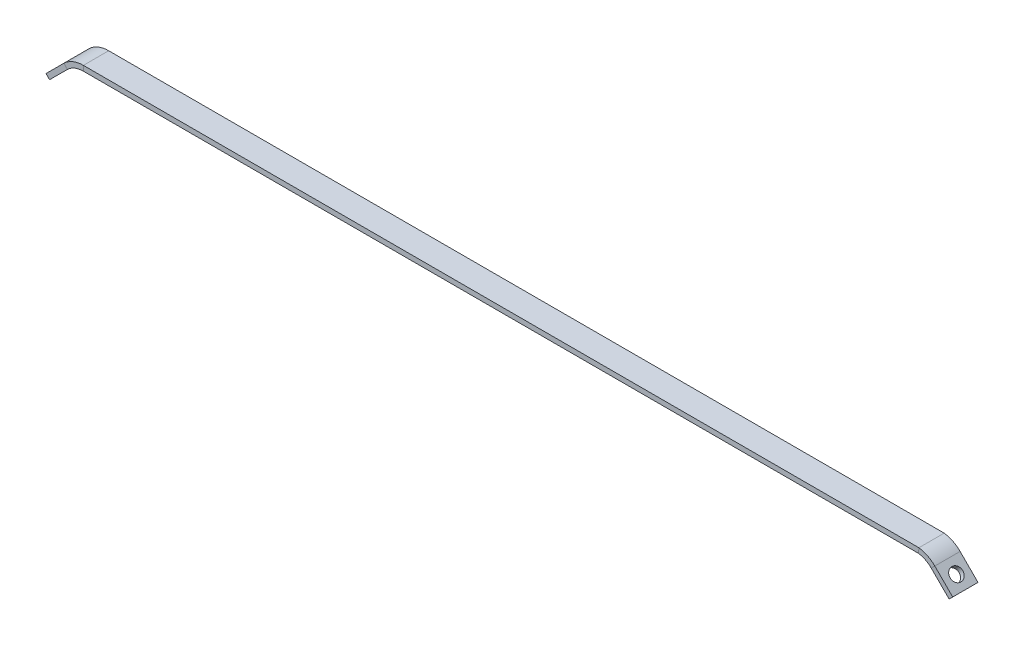
ISO-10303-21;
HEADER;
FILE_DESCRIPTION(('STEP AP214'),'2;1');
FILE_NAME('part.step','',(''),(''),'','','');
FILE_SCHEMA(('AUTOMOTIVE_DESIGN { 1 0 10303 214 1 1 1 1 }'));
ENDSEC;
DATA;
#1=APPLICATION_CONTEXT('core data for automotive mechanical design processes');
#2=APPLICATION_PROTOCOL_DEFINITION('international standard','automotive_design',2000,#1);
#3=PRODUCT_CONTEXT('',#1,'mechanical');
#4=PRODUCT('Part','Part','',(#3));
#5=PRODUCT_RELATED_PRODUCT_CATEGORY('part','',(#4));
#6=PRODUCT_DEFINITION_FORMATION('','',#4);
#7=PRODUCT_DEFINITION_CONTEXT('part definition',#1,'design');
#8=PRODUCT_DEFINITION('design','',#6,#7);
#9=PRODUCT_DEFINITION_SHAPE('','',#8);
#10=(LENGTH_UNIT() NAMED_UNIT(*) SI_UNIT(.MILLI.,.METRE.));
#11=(NAMED_UNIT(*) PLANE_ANGLE_UNIT() SI_UNIT($,.RADIAN.));
#12=(NAMED_UNIT(*) SI_UNIT($,.STERADIAN.) SOLID_ANGLE_UNIT());
#13=UNCERTAINTY_MEASURE_WITH_UNIT(LENGTH_MEASURE(1.E-05),#10,'distance_accuracy_value','');
#14=(GEOMETRIC_REPRESENTATION_CONTEXT(3) GLOBAL_UNCERTAINTY_ASSIGNED_CONTEXT((#13)) GLOBAL_UNIT_ASSIGNED_CONTEXT((#10,
#11,#12)) REPRESENTATION_CONTEXT('',''));
#15=CARTESIAN_POINT('',(0.,0.,0.));
#16=DIRECTION('',(0.,0.,1.));
#17=DIRECTION('',(1.,0.,0.));
#18=AXIS2_PLACEMENT_3D('',#15,#16,#17);
#19=CARTESIAN_POINT('',(233.630641333748,-9.89949493657192,0.));
#20=DIRECTION('',(-0.70710678118655,0.707106781186545,0.));
#21=DIRECTION('',(0.,0.,1.));
#22=AXIS2_PLACEMENT_3D('',#19,#20,#21);
#23=PLANE('',#22);
#24=DIRECTION('',(0.707106781186545,0.70710678118655,0.));
#25=VECTOR('',#24,1.);
#26=CARTESIAN_POINT('',(232.923534552561,-10.6066017177585,-5.));
#27=LINE('',#26,#25);
#28=CARTESIAN_POINT('',(232.923534552561,-10.6066017177585,-5.));
#29=VERTEX_POINT('',#28);
#30=CARTESIAN_POINT('',(234.337748114934,-9.19238815538537,-5.));
#31=VERTEX_POINT('',#30);
#32=EDGE_CURVE('E190',#29,#31,#27,.T.);
#33=ORIENTED_EDGE('',*,*,#32,.T.);
#34=DIRECTION('',(0.,0.,1.));
#35=VECTOR('',#34,1.);
#36=CARTESIAN_POINT('',(234.337748114934,-9.19238815538537,5.));
#37=LINE('',#36,#35);
#38=CARTESIAN_POINT('',(234.337748114934,-9.19238815538537,5.));
#39=VERTEX_POINT('',#38);
#40=EDGE_CURVE('E154',#31,#39,#37,.T.);
#41=ORIENTED_EDGE('',*,*,#40,.T.);
#42=DIRECTION('',(-0.707106781186545,-0.70710678118655,0.));
#43=VECTOR('',#42,1.);
#44=CARTESIAN_POINT('',(232.923534552561,-10.6066017177585,5.));
#45=LINE('',#44,#43);
#46=CARTESIAN_POINT('',(232.923534552561,-10.6066017177585,5.));
#47=VERTEX_POINT('',#46);
#48=EDGE_CURVE('E250',#39,#47,#45,.T.);
#49=ORIENTED_EDGE('',*,*,#48,.T.);
#50=DIRECTION('',(0.,0.,-1.));
#51=VECTOR('',#50,1.);
#52=CARTESIAN_POINT('',(232.923534552561,-10.6066017177585,5.));
#53=LINE('',#52,#51);
#54=EDGE_CURVE('E275',#47,#29,#53,.T.);
#55=ORIENTED_EDGE('',*,*,#54,.T.);
#56=EDGE_LOOP('',(#33,#41,#49,#55));
#57=FACE_BOUND('',#56,.T.);
#58=ADVANCED_FACE('F37',(#57),#23,.F.);
#59=CARTESIAN_POINT('',(-123.382306846173,-9.89949493657201,0.));
#60=DIRECTION('',(-0.707106781186549,-0.707106781186545,0.));
#61=DIRECTION('',(0.,0.,1.));
#62=AXIS2_PLACEMENT_3D('',#59,#60,#61);
#63=PLANE('',#62);
#64=DIRECTION('',(-0.707106781186546,0.707106781186549,0.));
#65=VECTOR('',#64,1.);
#66=CARTESIAN_POINT('',(-122.675200064987,-10.6066017177586,-5.));
#67=LINE('',#66,#65);
#68=CARTESIAN_POINT('',(-122.675200064987,-10.6066017177586,-5.));
#69=VERTEX_POINT('',#68);
#70=CARTESIAN_POINT('',(-124.08941362736,-9.19238815538546,-5.));
#71=VERTEX_POINT('',#70);
#72=EDGE_CURVE('E532',#69,#71,#67,.T.);
#73=ORIENTED_EDGE('',*,*,#72,.F.);
#74=DIRECTION('',(0.,0.,-1.));
#75=VECTOR('',#74,1.);
#76=CARTESIAN_POINT('',(-122.675200064987,-10.6066017177586,5.));
#77=LINE('',#76,#75);
#78=CARTESIAN_POINT('',(-122.675200064987,-10.6066017177586,5.));
#79=VERTEX_POINT('',#78);
#80=EDGE_CURVE('E534',#79,#69,#77,.T.);
#81=ORIENTED_EDGE('',*,*,#80,.F.);
#82=DIRECTION('',(0.707106781186546,-0.707106781186549,0.));
#83=VECTOR('',#82,1.);
#84=CARTESIAN_POINT('',(-122.675200064987,-10.6066017177586,5.));
#85=LINE('',#84,#83);
#86=CARTESIAN_POINT('',(-124.08941362736,-9.19238815538546,5.));
#87=VERTEX_POINT('',#86);
#88=EDGE_CURVE('E525',#87,#79,#85,.T.);
#89=ORIENTED_EDGE('',*,*,#88,.F.);
#90=DIRECTION('',(0.,0.,1.));
#91=VECTOR('',#90,1.);
#92=CARTESIAN_POINT('',(-124.08941362736,-9.19238815538546,5.));
#93=LINE('',#92,#91);
#94=EDGE_CURVE('E521',#71,#87,#93,.T.);
#95=ORIENTED_EDGE('',*,*,#94,.F.);
#96=EDGE_LOOP('',(#73,#81,#89,#95));
#97=FACE_BOUND('',#96,.T.);
#98=ADVANCED_FACE('F236',(#97),#63,.T.);
#99=CARTESIAN_POINT('',(220.563308017671,-0.961665222404171,-5.));
#100=DIRECTION('',(0.,0.,-1.));
#101=DIRECTION('',(-1.,0.,0.));
#102=AXIS2_PLACEMENT_3D('',#99,#100,#101);
#103=PLANE('',#102);
#104=DIRECTION('',(-0.0718254028954092,-0.997417220374158,0.));
#105=VECTOR('',#104,1.);
#106=CARTESIAN_POINT('',(220.973792776833,1.,-5.));
#107=LINE('',#106,#105);
#108=CARTESIAN_POINT('',(220.973792776833,0.999999798757574,-5.));
#109=VERTEX_POINT('',#108);
#110=CARTESIAN_POINT('',(220.829769991928,-1.,-5.));
#111=VERTEX_POINT('',#110);
#112=EDGE_CURVE('E137',#109,#111,#107,.T.);
#113=ORIENTED_EDGE('',*,*,#112,.F.);
#114=DIRECTION('',(0.989949493657198,-0.14142135626509,0.));
#115=VECTOR('',#114,1.);
#116=CARTESIAN_POINT('',(220.846150730201,1.01823376491023,-5.));
#117=LINE('',#116,#115);
#118=CARTESIAN_POINT('',(221.044140628933,0.989949493657208,-5.));
#119=VERTEX_POINT('',#118);
#120=EDGE_CURVE('E128',#109,#119,#117,.T.);
#121=ORIENTED_EDGE('',*,*,#120,.T.);
#122=CARTESIAN_POINT('',(219.488505710017,-9.89949493657198,-5.));
#123=DIRECTION('',(0.,0.,-1.));
#124=DIRECTION('',(0.141421356265083,0.989949493657199,0.));
#125=AXIS2_PLACEMENT_3D('',#122,#123,#124);
#126=CIRCLE('',#125,11.);
#127=CARTESIAN_POINT('',(227.266680303069,-2.12132034351993,-5.));
#128=VERTEX_POINT('',#127);
#129=EDGE_CURVE('E132',#119,#128,#126,.T.);
#130=ORIENTED_EDGE('',*,*,#129,.T.);
#131=DIRECTION('',(0.707106781186548,0.707106781186547,0.));
#132=VECTOR('',#131,1.);
#133=CARTESIAN_POINT('',(225.852466740696,-3.53553390589302,-5.));
#134=LINE('',#133,#132);
#135=CARTESIAN_POINT('',(225.852466740696,-3.53553390589302,-5.));
#136=VERTEX_POINT('',#135);
#137=EDGE_CURVE('E145',#136,#128,#134,.T.);
#138=ORIENTED_EDGE('',*,*,#137,.F.);
#139=CARTESIAN_POINT('',(219.488505710017,-9.89949493657198,-5.));
#140=DIRECTION('',(0.,0.,-1.));
#141=DIRECTION('',(0.141421356265085,0.989949493657199,0.));
#142=AXIS2_PLACEMENT_3D('',#139,#140,#141);
#143=CIRCLE('',#142,9.00000000000001);
#144=EDGE_CURVE('E194',#111,#136,#143,.T.);
#145=ORIENTED_EDGE('',*,*,#144,.F.);
#146=EDGE_LOOP('',(#113,#121,#130,#138,#145));
#147=FACE_BOUND('',#146,.T.);
#148=ADVANCED_FACE('F130',(#147),#103,.T.);
#149=CARTESIAN_POINT('',(220.563308017671,-0.961665222404171,5.));
#150=DIRECTION('',(0.,0.,1.));
#151=DIRECTION('',(1.,0.,0.));
#152=AXIS2_PLACEMENT_3D('',#149,#150,#151);
#153=PLANE('',#152);
#154=DIRECTION('',(0.0718254028954092,0.997417220374158,0.));
#155=VECTOR('',#154,1.);
#156=CARTESIAN_POINT('',(220.829769991928,-1.,5.));
#157=LINE('',#156,#155);
#158=CARTESIAN_POINT('',(220.829769991928,-1.,5.));
#159=VERTEX_POINT('',#158);
#160=CARTESIAN_POINT('',(220.973792776833,0.999999798757574,5.));
#161=VERTEX_POINT('',#160);
#162=EDGE_CURVE('E568',#159,#161,#157,.T.);
#163=ORIENTED_EDGE('',*,*,#162,.F.);
#164=CARTESIAN_POINT('',(219.488505710017,-9.89949493657198,5.));
#165=DIRECTION('',(0.,0.,-1.));
#166=DIRECTION('',(0.141421356265085,0.989949493657199,0.));
#167=AXIS2_PLACEMENT_3D('',#164,#165,#166);
#168=CIRCLE('',#167,9.00000000000001);
#169=CARTESIAN_POINT('',(225.852466740696,-3.53553390589302,5.));
#170=VERTEX_POINT('',#169);
#171=EDGE_CURVE('E256',#159,#170,#168,.T.);
#172=ORIENTED_EDGE('',*,*,#171,.T.);
#173=DIRECTION('',(-0.707106781186548,-0.707106781186547,0.));
#174=VECTOR('',#173,1.);
#175=CARTESIAN_POINT('',(225.852466740696,-3.53553390589302,5.));
#176=LINE('',#175,#174);
#177=CARTESIAN_POINT('',(227.266680303069,-2.12132034351992,5.));
#178=VERTEX_POINT('',#177);
#179=EDGE_CURVE('E253',#178,#170,#176,.T.);
#180=ORIENTED_EDGE('',*,*,#179,.F.);
#181=CARTESIAN_POINT('',(219.488505710017,-9.89949493657198,5.));
#182=DIRECTION('',(0.,0.,-1.));
#183=DIRECTION('',(0.141421356265083,0.989949493657199,0.));
#184=AXIS2_PLACEMENT_3D('',#181,#182,#183);
#185=CIRCLE('',#184,11.);
#186=CARTESIAN_POINT('',(221.044140628933,0.989949493657208,5.));
#187=VERTEX_POINT('',#186);
#188=EDGE_CURVE('E257',#187,#178,#185,.T.);
#189=ORIENTED_EDGE('',*,*,#188,.F.);
#190=DIRECTION('',(0.989949493657198,-0.14142135626509,0.));
#191=VECTOR('',#190,1.);
#192=CARTESIAN_POINT('',(220.846150730201,1.01823376491023,5.));
#193=LINE('',#192,#191);
#194=EDGE_CURVE('E40',#161,#187,#193,.T.);
#195=ORIENTED_EDGE('',*,*,#194,.F.);
#196=EDGE_LOOP('',(#163,#172,#180,#189,#195));
#197=FACE_BOUND('',#196,.T.);
#198=ADVANCED_FACE('F235',(#197),#153,.T.);
#199=CARTESIAN_POINT('',(219.488505710017,-9.89949493657198,0.));
#200=DIRECTION('',(0.,0.,-1.));
#201=DIRECTION('',(-1.,0.,0.));
#202=AXIS2_PLACEMENT_3D('',#199,#200,#201);
#203=CYLINDRICAL_SURFACE('',#202,9.00000000000001);
#204=ORIENTED_EDGE('',*,*,#171,.F.);
#205=DIRECTION('',(0.,0.,-1.));
#206=VECTOR('',#205,1.);
#207=CARTESIAN_POINT('',(220.829769991928,-0.999999999999999,0.));
#208=LINE('',#207,#206);
#209=EDGE_CURVE('E800',#159,#111,#208,.T.);
#210=ORIENTED_EDGE('',*,*,#209,.T.);
#211=ORIENTED_EDGE('',*,*,#144,.T.);
#212=DIRECTION('',(0.,0.,-1.));
#213=VECTOR('',#212,1.);
#214=CARTESIAN_POINT('',(225.852466740696,-3.53553390589302,5.));
#215=LINE('',#214,#213);
#216=EDGE_CURVE('E191',#170,#136,#215,.T.);
#217=ORIENTED_EDGE('',*,*,#216,.F.);
#218=EDGE_LOOP('',(#204,#210,#211,#217));
#219=FACE_BOUND('',#218,.T.);
#220=ADVANCED_FACE('F291',(#219),#203,.F.);
#221=CARTESIAN_POINT('',(225.852466740696,-3.53553390589302,-5.));
#222=DIRECTION('',(0.,0.,-1.));
#223=DIRECTION('',(-1.,0.,0.));
#224=AXIS2_PLACEMENT_3D('',#221,#222,#223);
#225=PLANE('',#224);
#226=DIRECTION('',(0.70710678118655,-0.707106781186545,0.));
#227=VECTOR('',#226,1.);
#228=CARTESIAN_POINT('',(227.266680303069,-2.12132034351992,-5.));
#229=LINE('',#228,#227);
#230=EDGE_CURVE('E193',#128,#31,#229,.T.);
#231=ORIENTED_EDGE('',*,*,#230,.T.);
#232=ORIENTED_EDGE('',*,*,#32,.F.);
#233=DIRECTION('',(0.70710678118655,-0.707106781186545,0.));
#234=VECTOR('',#233,1.);
#235=CARTESIAN_POINT('',(225.852466740696,-3.53553390589302,-5.));
#236=LINE('',#235,#234);
#237=EDGE_CURVE('E182',#136,#29,#236,.T.);
#238=ORIENTED_EDGE('',*,*,#237,.F.);
#239=ORIENTED_EDGE('',*,*,#137,.T.);
#240=EDGE_LOOP('',(#231,#232,#238,#239));
#241=FACE_BOUND('',#240,.T.);
#242=ADVANCED_FACE('F169',(#241),#225,.T.);
#243=CARTESIAN_POINT('',(227.266680303069,-2.12132034351992,5.));
#244=DIRECTION('',(0.707106781186545,0.70710678118655,0.));
#245=DIRECTION('',(-0.70710678118655,0.707106781186545,0.));
#246=AXIS2_PLACEMENT_3D('',#243,#244,#245);
#247=PLANE('',#246);
#248=CARTESIAN_POINT('',(230.802214209001,-5.65685424945261,0.));
#249=DIRECTION('',(0.707106781186545,0.70710678118655,0.));
#250=DIRECTION('',(-0.70710678118655,0.707106781186545,0.));
#251=AXIS2_PLACEMENT_3D('',#248,#249,#250);
#252=CIRCLE('',#251,2.5);
#253=CARTESIAN_POINT('',(229.034447256035,-3.88908729648625,0.));
#254=VERTEX_POINT('',#253);
#255=EDGE_CURVE('E788',#254,#254,#252,.F.);
#256=ORIENTED_EDGE('',*,*,#255,.T.);
#257=EDGE_LOOP('',(#256));
#258=FACE_BOUND('',#257,.T.);
#259=DIRECTION('',(0.70710678118655,-0.707106781186545,0.));
#260=VECTOR('',#259,1.);
#261=CARTESIAN_POINT('',(227.266680303069,-2.12132034351992,5.));
#262=LINE('',#261,#260);
#263=EDGE_CURVE('E242',#178,#39,#262,.T.);
#264=ORIENTED_EDGE('',*,*,#263,.T.);
#265=ORIENTED_EDGE('',*,*,#40,.F.);
#266=ORIENTED_EDGE('',*,*,#230,.F.);
#267=DIRECTION('',(0.,0.,1.));
#268=VECTOR('',#267,1.);
#269=CARTESIAN_POINT('',(227.266680303069,-2.12132034351992,5.));
#270=LINE('',#269,#268);
#271=EDGE_CURVE('E144',#128,#178,#270,.T.);
#272=ORIENTED_EDGE('',*,*,#271,.T.);
#273=EDGE_LOOP('',(#264,#265,#266,#272));
#274=FACE_BOUND('',#273,.T.);
#275=ADVANCED_FACE('F171',(#258,#274),#247,.T.);
#276=CARTESIAN_POINT('',(225.852466740696,-3.53553390589302,5.));
#277=DIRECTION('',(0.,0.,1.));
#278=DIRECTION('',(1.,0.,0.));
#279=AXIS2_PLACEMENT_3D('',#276,#277,#278);
#280=PLANE('',#279);
#281=DIRECTION('',(0.70710678118655,-0.707106781186545,0.));
#282=VECTOR('',#281,1.);
#283=CARTESIAN_POINT('',(225.852466740696,-3.53553390589302,5.));
#284=LINE('',#283,#282);
#285=EDGE_CURVE('E805',#170,#47,#284,.T.);
#286=ORIENTED_EDGE('',*,*,#285,.T.);
#287=ORIENTED_EDGE('',*,*,#48,.F.);
#288=ORIENTED_EDGE('',*,*,#263,.F.);
#289=ORIENTED_EDGE('',*,*,#179,.T.);
#290=EDGE_LOOP('',(#286,#287,#288,#289));
#291=FACE_BOUND('',#290,.T.);
#292=ADVANCED_FACE('F292',(#291),#280,.T.);
#293=CARTESIAN_POINT('',(225.852466740696,-3.53553390589302,5.));
#294=DIRECTION('',(-0.707106781186545,-0.70710678118655,0.));
#295=DIRECTION('',(0.70710678118655,-0.707106781186545,0.));
#296=AXIS2_PLACEMENT_3D('',#293,#294,#295);
#297=PLANE('',#296);
#298=CARTESIAN_POINT('',(229.388000646628,-7.07106781182612,0.));
#299=DIRECTION('',(-0.707106781186548,-0.707106781186547,0.));
#300=DIRECTION('',(0.707106781186547,-0.707106781186548,0.));
#301=AXIS2_PLACEMENT_3D('',#298,#299,#300);
#302=CIRCLE('',#301,2.5);
#303=CARTESIAN_POINT('',(231.155767599594,-8.83883476479249,0.));
#304=VERTEX_POINT('',#303);
#305=EDGE_CURVE('E785',#304,#304,#302,.T.);
#306=ORIENTED_EDGE('',*,*,#305,.F.);
#307=EDGE_LOOP('',(#306));
#308=FACE_BOUND('',#307,.T.);
#309=ORIENTED_EDGE('',*,*,#54,.F.);
#310=ORIENTED_EDGE('',*,*,#285,.F.);
#311=ORIENTED_EDGE('',*,*,#216,.T.);
#312=ORIENTED_EDGE('',*,*,#237,.T.);
#313=EDGE_LOOP('',(#309,#310,#311,#312));
#314=FACE_BOUND('',#313,.T.);
#315=ADVANCED_FACE('F168',(#308,#314),#297,.T.);
#316=CARTESIAN_POINT('',(220.846150730201,1.01823376491023,-5.));
#317=CARTESIAN_POINT('',(220.914625686608,1.00845162827871,-5.));
#318=CARTESIAN_POINT('',(220.974844453874,0.999850799182073,-5.));
#319=CARTESIAN_POINT('',(221.323198589603,0.950076612860821,-5.));
#320=CARTESIAN_POINT('',(221.626964067869,0.894672744397737,-5.));
#321=CARTESIAN_POINT('',(222.20254922889,0.76451124549653,-5.));
#322=CARTESIAN_POINT('',(222.487656849468,0.687861068071694,-5.));
#323=CARTESIAN_POINT('',(223.332329715827,0.423928716363114,-5.));
#324=CARTESIAN_POINT('',(223.881232147002,0.202580142086091,-5.));
#325=CARTESIAN_POINT('',(225.463987163258,-0.588990805081804,-5.));
#326=CARTESIAN_POINT('',(226.432672669938,-1.28731271038902,-5.));
#327=CARTESIAN_POINT('',(227.266680303069,-2.12132034351992,-5.));
#328=CARTESIAN_POINT('',(220.846150730201,1.01823376491023,5.));
#329=CARTESIAN_POINT('',(220.914625686608,1.00845162827871,5.));
#330=CARTESIAN_POINT('',(220.974844453874,0.999850799182073,5.));
#331=CARTESIAN_POINT('',(221.323198589603,0.950076612860821,5.));
#332=CARTESIAN_POINT('',(221.626964067869,0.894672744397737,5.));
#333=CARTESIAN_POINT('',(222.20254922889,0.76451124549653,5.));
#334=CARTESIAN_POINT('',(222.487656849468,0.687861068071694,5.));
#335=CARTESIAN_POINT('',(223.332329715827,0.423928716363114,5.));
#336=CARTESIAN_POINT('',(223.881232147002,0.202580142086091,5.));
#337=CARTESIAN_POINT('',(225.463987163258,-0.588990805081804,5.));
#338=CARTESIAN_POINT('',(226.432672669938,-1.28731271038902,5.));
#339=CARTESIAN_POINT('',(227.266680303069,-2.12132034351992,5.));
#340=B_SPLINE_SURFACE_WITH_KNOTS('',1,3,((#316,#317,#318,#319,#320,#321,#322,#323,#324,#325,
#326,#327),(#328,#329,#330,#331,#332,#333,#334,#335,#336,#337,#338,#339)),.UNSPECIFIED.,.F.,.F.,
.F.,(2,2),(4,2,2,2,2,4),(0.,1.),(-0.0121535781666568,0.,0.0489428563002833,0.0978857126005665,
0.195771425201133,0.391542850402266),.UNSPECIFIED.);
#341=DIRECTION('',(0.,0.,1.));
#342=VECTOR('',#341,1.);
#343=CARTESIAN_POINT('',(220.973792834331,1.,0.));
#344=LINE('',#343,#342);
#345=EDGE_CURVE('E572',#161,#109,#344,.F.);
#346=ORIENTED_EDGE('',*,*,#345,.F.);
#347=ORIENTED_EDGE('',*,*,#194,.T.);
#348=ORIENTED_EDGE('',*,*,#188,.T.);
#349=ORIENTED_EDGE('',*,*,#271,.F.);
#350=ORIENTED_EDGE('',*,*,#129,.F.);
#351=ORIENTED_EDGE('',*,*,#120,.F.);
#352=EDGE_LOOP('',(#346,#347,#348,#349,#350,#351));
#353=FACE_BOUND('',#352,.T.);
#354=ADVANCED_FACE('F142',(#353),#340,.T.);
#355=CARTESIAN_POINT('',(-109.311239034308,-1.,5.));
#356=DIRECTION('',(0.,-1.,0.));
#357=DIRECTION('',(0.,0.,-1.));
#358=AXIS2_PLACEMENT_3D('',#355,#356,#357);
#359=PLANE('',#358);
#360=ORIENTED_EDGE('',*,*,#209,.F.);
#361=DIRECTION('',(1.,0.,0.));
#362=VECTOR('',#361,1.);
#363=CARTESIAN_POINT('',(-109.311239034308,-1.,5.));
#364=LINE('',#363,#362);
#365=CARTESIAN_POINT('',(-109.312780914113,-0.9999973848605,5.));
#366=VERTEX_POINT('',#365);
#367=EDGE_CURVE('E219',#366,#159,#364,.T.);
#368=ORIENTED_EDGE('',*,*,#367,.F.);
#369=DIRECTION('',(0.,0.,-1.));
#370=VECTOR('',#369,1.);
#371=CARTESIAN_POINT('',(-109.314322794863,-0.999995245199113,5.));
#372=LINE('',#371,#370);
#373=CARTESIAN_POINT('',(-109.312780914113,-0.9999973848605,-5.));
#374=VERTEX_POINT('',#373);
#375=EDGE_CURVE('E201',#366,#374,#372,.T.);
#376=ORIENTED_EDGE('',*,*,#375,.T.);
#377=DIRECTION('',(1.,0.,0.));
#378=VECTOR('',#377,1.);
#379=CARTESIAN_POINT('',(-109.311239034308,-1.,-5.));
#380=LINE('',#379,#378);
#381=EDGE_CURVE('E802',#374,#111,#380,.T.);
#382=ORIENTED_EDGE('',*,*,#381,.T.);
#383=EDGE_LOOP('',(#360,#368,#376,#382));
#384=FACE_BOUND('',#383,.T.);
#385=ADVANCED_FACE('F167',(#384),#359,.T.);
#386=CARTESIAN_POINT('',(-109.311239034308,1.,5.));
#387=DIRECTION('',(0.,1.,0.));
#388=DIRECTION('',(0.,0.,1.));
#389=AXIS2_PLACEMENT_3D('',#386,#387,#388);
#390=PLANE('',#389);
#391=DIRECTION('',(1.,0.,0.));
#392=VECTOR('',#391,1.);
#393=CARTESIAN_POINT('',(-109.311239034308,1.,5.));
#394=LINE('',#393,#392);
#395=CARTESIAN_POINT('',(-109.309697154502,0.999997384860501,5.));
#396=VERTEX_POINT('',#395);
#397=EDGE_CURVE('E801',#396,#161,#394,.T.);
#398=ORIENTED_EDGE('',*,*,#397,.T.);
#399=ORIENTED_EDGE('',*,*,#345,.T.);
#400=DIRECTION('',(1.,0.,0.));
#401=VECTOR('',#400,1.);
#402=CARTESIAN_POINT('',(-109.311239034308,1.,-5.));
#403=LINE('',#402,#401);
#404=CARTESIAN_POINT('',(-109.309697154502,0.999997384860501,-5.));
#405=VERTEX_POINT('',#404);
#406=EDGE_CURVE('E448',#405,#109,#403,.T.);
#407=ORIENTED_EDGE('',*,*,#406,.F.);
#408=DIRECTION('',(0.,0.,1.));
#409=VECTOR('',#408,1.);
#410=CARTESIAN_POINT('',(-109.308155273752,0.999995245199113,5.));
#411=LINE('',#410,#409);
#412=EDGE_CURVE('E443',#405,#396,#411,.T.);
#413=ORIENTED_EDGE('',*,*,#412,.T.);
#414=EDGE_LOOP('',(#398,#399,#407,#413));
#415=FACE_BOUND('',#414,.T.);
#416=ADVANCED_FACE('F229',(#415),#390,.T.);
#417=CARTESIAN_POINT('',(-109.311239034308,-1.,5.));
#418=DIRECTION('',(0.,0.,1.));
#419=DIRECTION('',(1.,0.,0.));
#420=AXIS2_PLACEMENT_3D('',#417,#418,#419);
#421=PLANE('',#420);
#422=ORIENTED_EDGE('',*,*,#367,.T.);
#423=ORIENTED_EDGE('',*,*,#162,.T.);
#424=ORIENTED_EDGE('',*,*,#397,.F.);
#425=DIRECTION('',(-0.00308376055572074,-0.999995245199114,0.));
#426=VECTOR('',#425,1.);
#427=CARTESIAN_POINT('',(-109.314322794863,-0.999995245199113,5.));
#428=LINE('',#427,#426);
#429=EDGE_CURVE('E492',#396,#366,#428,.T.);
#430=ORIENTED_EDGE('',*,*,#429,.T.);
#431=EDGE_LOOP('',(#422,#423,#424,#430));
#432=FACE_BOUND('',#431,.T.);
#433=ADVANCED_FACE('F230',(#432),#421,.T.);
#434=CARTESIAN_POINT('',(-109.311239034308,-1.,-5.));
#435=DIRECTION('',(0.,0.,-1.));
#436=DIRECTION('',(-1.,0.,0.));
#437=AXIS2_PLACEMENT_3D('',#434,#435,#436);
#438=PLANE('',#437);
#439=ORIENTED_EDGE('',*,*,#406,.T.);
#440=ORIENTED_EDGE('',*,*,#112,.T.);
#441=ORIENTED_EDGE('',*,*,#381,.F.);
#442=DIRECTION('',(0.00308376055572074,0.999995245199114,0.));
#443=VECTOR('',#442,1.);
#444=CARTESIAN_POINT('',(-109.314322794863,-0.999995245199113,-5.));
#445=LINE('',#444,#443);
#446=EDGE_CURVE('E196',#374,#405,#445,.T.);
#447=ORIENTED_EDGE('',*,*,#446,.T.);
#448=EDGE_LOOP('',(#439,#440,#441,#447));
#449=FACE_BOUND('',#448,.T.);
#450=ADVANCED_FACE('F458',(#449),#438,.T.);
#451=CARTESIAN_POINT('',(-115.614322794863,-3.545579657435,-5.));
#452=DIRECTION('',(0.,0.,-1.));
#453=DIRECTION('',(-1.,0.,0.));
#454=AXIS2_PLACEMENT_3D('',#451,#452,#453);
#455=PLANE('',#454);
#456=CARTESIAN_POINT('',(-109.342076639865,-9.99995245199114,-5.));
#457=DIRECTION('',(0.,0.,-1.));
#458=DIRECTION('',(-0.696916239444279,0.717152532728459,0.));
#459=AXIS2_PLACEMENT_3D('',#456,#457,#458);
#460=CIRCLE('',#459,11.);
#461=CARTESIAN_POINT('',(-117.01324756443,-2.11630051988032,-5.));
#462=VERTEX_POINT('',#461);
#463=EDGE_CURVE('E199',#462,#405,#460,.T.);
#464=ORIENTED_EDGE('',*,*,#463,.T.);
#465=ORIENTED_EDGE('',*,*,#446,.F.);
#466=CARTESIAN_POINT('',(-109.342076639865,-9.99995245199114,-5.));
#467=DIRECTION('',(0.,0.,-1.));
#468=DIRECTION('',(-0.69691623944428,0.717152532728459,0.));
#469=AXIS2_PLACEMENT_3D('',#466,#467,#468);
#470=CIRCLE('',#469,9.00000000000001);
#471=CARTESIAN_POINT('',(-115.609230504186,-3.54055372953277,-5.));
#472=VERTEX_POINT('',#471);
#473=EDGE_CURVE('E200',#472,#374,#470,.T.);
#474=ORIENTED_EDGE('',*,*,#473,.F.);
#475=DIRECTION('',(-0.707106781186546,0.707106781186549,0.));
#476=VECTOR('',#475,1.);
#477=CARTESIAN_POINT('',(-115.604132253121,-3.53553390589309,-5.));
#478=LINE('',#477,#476);
#479=EDGE_CURVE('E359',#472,#462,#478,.T.);
#480=ORIENTED_EDGE('',*,*,#479,.T.);
#481=EDGE_LOOP('',(#464,#465,#474,#480));
#482=FACE_BOUND('',#481,.T.);
#483=ADVANCED_FACE('F330',(#482),#455,.T.);
#484=CARTESIAN_POINT('',(-109.342076639865,-9.99995245199114,0.));
#485=DIRECTION('',(0.,0.,-1.));
#486=DIRECTION('',(-1.,0.,0.));
#487=AXIS2_PLACEMENT_3D('',#484,#485,#486);
#488=CYLINDRICAL_SURFACE('',#487,11.);
#489=CARTESIAN_POINT('',(-109.342076639865,-9.99995245199114,5.));
#490=DIRECTION('',(0.,0.,-1.));
#491=DIRECTION('',(-0.696916239444279,0.717152532728459,0.));
#492=AXIS2_PLACEMENT_3D('',#489,#490,#491);
#493=CIRCLE('',#492,11.);
#494=CARTESIAN_POINT('',(-117.014273912048,-2.11729766650933,5.));
#495=VERTEX_POINT('',#494);
#496=EDGE_CURVE('E485',#495,#396,#493,.T.);
#497=ORIENTED_EDGE('',*,*,#496,.T.);
#498=ORIENTED_EDGE('',*,*,#412,.F.);
#499=ORIENTED_EDGE('',*,*,#463,.F.);
#500=DIRECTION('',(0.,0.,1.));
#501=VECTOR('',#500,1.);
#502=CARTESIAN_POINT('',(-117.018345815494,-2.12132034351999,5.));
#503=LINE('',#502,#501);
#504=EDGE_CURVE('E378',#462,#495,#503,.T.);
#505=ORIENTED_EDGE('',*,*,#504,.T.);
#506=EDGE_LOOP('',(#497,#498,#499,#505));
#507=FACE_BOUND('',#506,.T.);
#508=ADVANCED_FACE('F414',(#507),#488,.T.);
#509=CARTESIAN_POINT('',(-115.614322794863,-3.545579657435,5.));
#510=DIRECTION('',(0.,0.,1.));
#511=DIRECTION('',(1.,0.,0.));
#512=AXIS2_PLACEMENT_3D('',#509,#510,#511);
#513=PLANE('',#512);
#514=CARTESIAN_POINT('',(-109.342076639865,-9.99995245199114,5.));
#515=DIRECTION('',(0.,0.,-1.));
#516=DIRECTION('',(-0.69691623944428,0.717152532728459,0.));
#517=AXIS2_PLACEMENT_3D('',#514,#515,#516);
#518=CIRCLE('',#517,9.00000000000001);
#519=CARTESIAN_POINT('',(-115.609230504186,-3.54055372953277,5.));
#520=VERTEX_POINT('',#519);
#521=EDGE_CURVE('E500',#520,#366,#518,.T.);
#522=ORIENTED_EDGE('',*,*,#521,.T.);
#523=ORIENTED_EDGE('',*,*,#429,.F.);
#524=ORIENTED_EDGE('',*,*,#496,.F.);
#525=DIRECTION('',(0.707106781186546,-0.707106781186549,0.));
#526=VECTOR('',#525,1.);
#527=CARTESIAN_POINT('',(-115.604132253121,-3.53553390589309,5.));
#528=LINE('',#527,#526);
#529=EDGE_CURVE('E56',#495,#520,#528,.T.);
#530=ORIENTED_EDGE('',*,*,#529,.T.);
#531=EDGE_LOOP('',(#522,#523,#524,#530));
#532=FACE_BOUND('',#531,.T.);
#533=ADVANCED_FACE('F423',(#532),#513,.T.);
#534=CARTESIAN_POINT('',(-109.342076639865,-9.99995245199114,0.));
#535=DIRECTION('',(0.,0.,-1.));
#536=DIRECTION('',(-1.,0.,0.));
#537=AXIS2_PLACEMENT_3D('',#534,#535,#536);
#538=CYLINDRICAL_SURFACE('',#537,9.00000000000001);
#539=ORIENTED_EDGE('',*,*,#375,.F.);
#540=ORIENTED_EDGE('',*,*,#521,.F.);
#541=DIRECTION('',(0.,0.,-1.));
#542=VECTOR('',#541,1.);
#543=CARTESIAN_POINT('',(-115.604132253121,-3.53553390589309,5.));
#544=LINE('',#543,#542);
#545=EDGE_CURVE('E11',#520,#472,#544,.T.);
#546=ORIENTED_EDGE('',*,*,#545,.T.);
#547=ORIENTED_EDGE('',*,*,#473,.T.);
#548=EDGE_LOOP('',(#539,#540,#546,#547));
#549=FACE_BOUND('',#548,.T.);
#550=ADVANCED_FACE('F388',(#549),#538,.F.);
#551=CARTESIAN_POINT('',(-122.675200064987,-10.6066017177586,-5.));
#552=DIRECTION('',(0.,0.,-1.));
#553=DIRECTION('',(-1.,0.,0.));
#554=AXIS2_PLACEMENT_3D('',#551,#552,#553);
#555=PLANE('',#554);
#556=DIRECTION('',(0.707106781186549,0.707106781186546,0.));
#557=VECTOR('',#556,1.);
#558=CARTESIAN_POINT('',(-124.08941362736,-9.19238815538546,-5.));
#559=LINE('',#558,#557);
#560=EDGE_CURVE('E400',#71,#462,#559,.T.);
#561=ORIENTED_EDGE('',*,*,#560,.T.);
#562=ORIENTED_EDGE('',*,*,#479,.F.);
#563=DIRECTION('',(0.707106781186549,0.707106781186546,0.));
#564=VECTOR('',#563,1.);
#565=CARTESIAN_POINT('',(-122.675200064987,-10.6066017177586,-5.));
#566=LINE('',#565,#564);
#567=EDGE_CURVE('E536',#69,#472,#566,.T.);
#568=ORIENTED_EDGE('',*,*,#567,.F.);
#569=ORIENTED_EDGE('',*,*,#72,.T.);
#570=EDGE_LOOP('',(#561,#562,#568,#569));
#571=FACE_BOUND('',#570,.T.);
#572=ADVANCED_FACE('F380',(#571),#555,.T.);
#573=CARTESIAN_POINT('',(-124.08941362736,-9.19238815538546,5.));
#574=DIRECTION('',(-0.707106781186546,0.707106781186549,0.));
#575=DIRECTION('',(-0.707106781186549,-0.707106781186546,0.));
#576=AXIS2_PLACEMENT_3D('',#573,#574,#575);
#577=PLANE('',#576);
#578=CARTESIAN_POINT('',(-120.556409240103,-5.6593837681287,0.));
#579=DIRECTION('',(-0.707106781186546,0.707106781186549,0.));
#580=DIRECTION('',(-0.707106781186549,-0.707106781186546,0.));
#581=AXIS2_PLACEMENT_3D('',#578,#579,#580);
#582=CIRCLE('',#581,2.5);
#583=CARTESIAN_POINT('',(-122.324176193069,-7.42715072109506,0.));
#584=VERTEX_POINT('',#583);
#585=EDGE_CURVE('E139',#584,#584,#582,.T.);
#586=ORIENTED_EDGE('',*,*,#585,.F.);
#587=EDGE_LOOP('',(#586));
#588=FACE_BOUND('',#587,.T.);
#589=DIRECTION('',(0.707106781186549,0.707106781186546,0.));
#590=VECTOR('',#589,1.);
#591=CARTESIAN_POINT('',(-124.08941362736,-9.19238815538546,5.));
#592=LINE('',#591,#590);
#593=EDGE_CURVE('E351',#87,#495,#592,.T.);
#594=ORIENTED_EDGE('',*,*,#593,.T.);
#595=ORIENTED_EDGE('',*,*,#504,.F.);
#596=ORIENTED_EDGE('',*,*,#560,.F.);
#597=ORIENTED_EDGE('',*,*,#94,.T.);
#598=EDGE_LOOP('',(#594,#595,#596,#597));
#599=FACE_BOUND('',#598,.T.);
#600=ADVANCED_FACE('F321',(#588,#599),#577,.T.);
#601=CARTESIAN_POINT('',(-122.675200064987,-10.6066017177586,5.));
#602=DIRECTION('',(0.,0.,1.));
#603=DIRECTION('',(1.,0.,0.));
#604=AXIS2_PLACEMENT_3D('',#601,#602,#603);
#605=PLANE('',#604);
#606=DIRECTION('',(0.707106781186549,0.707106781186546,0.));
#607=VECTOR('',#606,1.);
#608=CARTESIAN_POINT('',(-122.675200064987,-10.6066017177586,5.));
#609=LINE('',#608,#607);
#610=EDGE_CURVE('E47',#79,#520,#609,.T.);
#611=ORIENTED_EDGE('',*,*,#610,.T.);
#612=ORIENTED_EDGE('',*,*,#529,.F.);
#613=ORIENTED_EDGE('',*,*,#593,.F.);
#614=ORIENTED_EDGE('',*,*,#88,.T.);
#615=EDGE_LOOP('',(#611,#612,#613,#614));
#616=FACE_BOUND('',#615,.T.);
#617=ADVANCED_FACE('F311',(#616),#605,.T.);
#618=CARTESIAN_POINT('',(-122.675200064987,-10.6066017177586,5.));
#619=DIRECTION('',(0.707106781186546,-0.707106781186549,0.));
#620=DIRECTION('',(0.707106781186549,0.707106781186546,0.));
#621=AXIS2_PLACEMENT_3D('',#618,#619,#620);
#622=PLANE('',#621);
#623=CARTESIAN_POINT('',(-119.142195677731,-7.07359733050027,0.));
#624=DIRECTION('',(0.707106781186529,-0.707106781186567,0.));
#625=DIRECTION('',(0.707106781186567,0.707106781186529,0.));
#626=AXIS2_PLACEMENT_3D('',#623,#624,#625);
#627=CIRCLE('',#626,2.5);
#628=CARTESIAN_POINT('',(-117.374428724765,-5.30583037753395,0.));
#629=VERTEX_POINT('',#628);
#630=EDGE_CURVE('E789',#629,#629,#627,.T.);
#631=ORIENTED_EDGE('',*,*,#630,.F.);
#632=EDGE_LOOP('',(#631));
#633=FACE_BOUND('',#632,.T.);
#634=ORIENTED_EDGE('',*,*,#545,.F.);
#635=ORIENTED_EDGE('',*,*,#610,.F.);
#636=ORIENTED_EDGE('',*,*,#80,.T.);
#637=ORIENTED_EDGE('',*,*,#567,.T.);
#638=EDGE_LOOP('',(#634,#635,#636,#637));
#639=FACE_BOUND('',#638,.T.);
#640=ADVANCED_FACE('F309',(#633,#639),#622,.T.);
#641=CARTESIAN_POINT('',(-126.213263489597,-0.0025295186346086,0.));
#642=DIRECTION('',(0.707106781186529,-0.707106781186567,0.));
#643=DIRECTION('',(0.707106781186567,0.707106781186529,0.));
#644=AXIS2_PLACEMENT_3D('',#641,#642,#643);
#645=CYLINDRICAL_SURFACE('',#644,2.5);
#646=ORIENTED_EDGE('',*,*,#585,.T.);
#647=EDGE_LOOP('',(#646));
#648=FACE_BOUND('',#647,.T.);
#649=ORIENTED_EDGE('',*,*,#630,.T.);
#650=EDGE_LOOP('',(#649));
#651=FACE_BOUND('',#650,.T.);
#652=ADVANCED_FACE('F307',(#648,#651),#645,.F.);
#653=CARTESIAN_POINT('',(235.802214209002,-0.656854249452604,0.));
#654=DIRECTION('',(-0.707106781186548,-0.707106781186547,0.));
#655=DIRECTION('',(0.707106781186547,-0.707106781186548,0.));
#656=AXIS2_PLACEMENT_3D('',#653,#654,#655);
#657=CYLINDRICAL_SURFACE('',#656,2.5);
#658=ORIENTED_EDGE('',*,*,#305,.T.);
#659=EDGE_LOOP('',(#658));
#660=FACE_BOUND('',#659,.T.);
#661=ORIENTED_EDGE('',*,*,#255,.F.);
#662=EDGE_LOOP('',(#661));
#663=FACE_BOUND('',#662,.T.);
#664=ADVANCED_FACE('F318',(#660,#663),#657,.F.);
#665=CLOSED_SHELL('',(#58,#98,#148,#198,#220,#242,#275,#292,#315,#354,#385,#416,#433,#450,#483,
#508,#533,#550,#572,#600,#617,#640,#652,#664));
#666=MANIFOLD_SOLID_BREP('B2',#665);
#667=ADVANCED_BREP_SHAPE_REPRESENTATION('',(#18,#666),#14);
#668=SHAPE_DEFINITION_REPRESENTATION(#9,#667);
ENDSEC;
END-ISO-10303-21;
